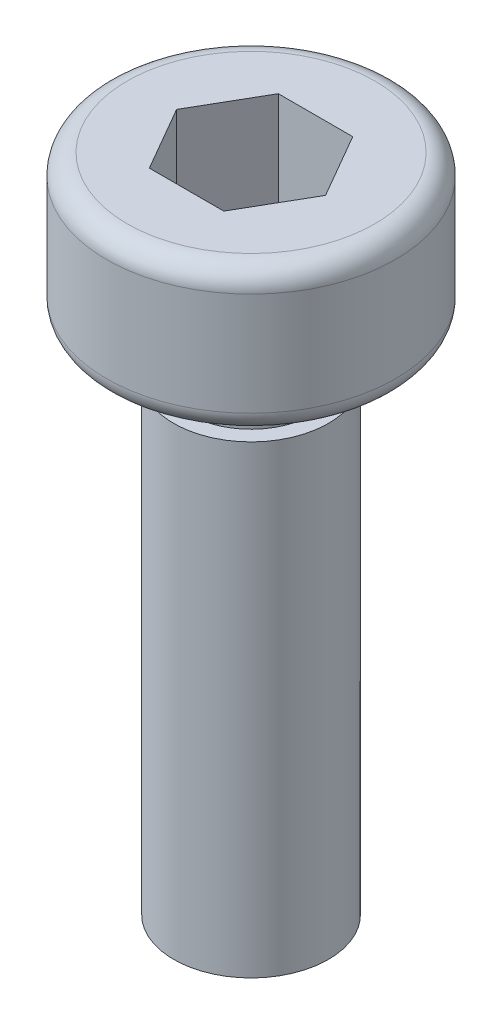
ISO-10303-21;
HEADER;
FILE_DESCRIPTION(('STEP AP214'),'2;1');
FILE_NAME('part.step','',(''),(''),'','','');
FILE_SCHEMA(('AUTOMOTIVE_DESIGN { 1 0 10303 214 1 1 1 1 }'));
ENDSEC;
DATA;
#1=APPLICATION_CONTEXT('core data for automotive mechanical design processes');
#2=APPLICATION_PROTOCOL_DEFINITION('international standard','automotive_design',2000,#1);
#3=PRODUCT_CONTEXT('',#1,'mechanical');
#4=PRODUCT('Part','Part','',(#3));
#5=PRODUCT_RELATED_PRODUCT_CATEGORY('part','',(#4));
#6=PRODUCT_DEFINITION_FORMATION('','',#4);
#7=PRODUCT_DEFINITION_CONTEXT('part definition',#1,'design');
#8=PRODUCT_DEFINITION('design','',#6,#7);
#9=PRODUCT_DEFINITION_SHAPE('','',#8);
#10=(LENGTH_UNIT() NAMED_UNIT(*) SI_UNIT(.MILLI.,.METRE.));
#11=(NAMED_UNIT(*) PLANE_ANGLE_UNIT() SI_UNIT($,.RADIAN.));
#12=(NAMED_UNIT(*) SI_UNIT($,.STERADIAN.) SOLID_ANGLE_UNIT());
#13=UNCERTAINTY_MEASURE_WITH_UNIT(LENGTH_MEASURE(1.E-05),#10,'distance_accuracy_value','');
#14=(GEOMETRIC_REPRESENTATION_CONTEXT(3) GLOBAL_UNCERTAINTY_ASSIGNED_CONTEXT((#13)) GLOBAL_UNIT_ASSIGNED_CONTEXT((#10,
#11,#12)) REPRESENTATION_CONTEXT('',''));
#15=CARTESIAN_POINT('',(0.,0.,0.));
#16=DIRECTION('',(0.,0.,1.));
#17=DIRECTION('',(1.,0.,0.));
#18=AXIS2_PLACEMENT_3D('',#15,#16,#17);
#19=CARTESIAN_POINT('',(0.,12.8,0.));
#20=DIRECTION('',(0.,-1.,0.));
#21=DIRECTION('',(0.,0.,-1.));
#22=AXIS2_PLACEMENT_3D('',#19,#20,#21);
#23=PLANE('',#22);
#24=DIRECTION('',(-0.5,0.,0.866025403784439));
#25=VECTOR('',#24,1.);
#26=CARTESIAN_POINT('',(-0.721687836487032,12.8,-1.25));
#27=LINE('',#26,#25);
#28=CARTESIAN_POINT('',(-0.721687836487032,12.8,-1.25));
#29=VERTEX_POINT('',#28);
#30=CARTESIAN_POINT('',(-1.44337567297406,12.8,0.));
#31=VERTEX_POINT('',#30);
#32=EDGE_CURVE('E124',#29,#31,#27,.T.);
#33=ORIENTED_EDGE('',*,*,#32,.F.);
#34=DIRECTION('',(-1.,0.,0.));
#35=VECTOR('',#34,1.);
#36=CARTESIAN_POINT('',(0.721687836487033,12.8,-1.25));
#37=LINE('',#36,#35);
#38=CARTESIAN_POINT('',(0.721687836487033,12.8,-1.25));
#39=VERTEX_POINT('',#38);
#40=EDGE_CURVE('E50',#39,#29,#37,.T.);
#41=ORIENTED_EDGE('',*,*,#40,.F.);
#42=DIRECTION('',(-0.5,0.,-0.866025403784439));
#43=VECTOR('',#42,1.);
#44=CARTESIAN_POINT('',(1.44337567297406,12.8,0.));
#45=LINE('',#44,#43);
#46=CARTESIAN_POINT('',(1.44337567297406,12.8,0.));
#47=VERTEX_POINT('',#46);
#48=EDGE_CURVE('E133',#47,#39,#45,.T.);
#49=ORIENTED_EDGE('',*,*,#48,.F.);
#50=DIRECTION('',(0.5,0.,-0.866025403784439));
#51=VECTOR('',#50,1.);
#52=CARTESIAN_POINT('',(0.721687836487032,12.8,1.25));
#53=LINE('',#52,#51);
#54=CARTESIAN_POINT('',(0.721687836487032,12.8,1.25));
#55=VERTEX_POINT('',#54);
#56=EDGE_CURVE('E131',#55,#47,#53,.T.);
#57=ORIENTED_EDGE('',*,*,#56,.F.);
#58=DIRECTION('',(1.,0.,0.));
#59=VECTOR('',#58,1.);
#60=CARTESIAN_POINT('',(-0.721687836487033,12.8,1.25));
#61=LINE('',#60,#59);
#62=CARTESIAN_POINT('',(-0.721687836487033,12.8,1.25));
#63=VERTEX_POINT('',#62);
#64=EDGE_CURVE('E98',#63,#55,#61,.T.);
#65=ORIENTED_EDGE('',*,*,#64,.F.);
#66=DIRECTION('',(0.5,0.,0.866025403784439));
#67=VECTOR('',#66,1.);
#68=CARTESIAN_POINT('',(-1.44337567297406,12.8,0.));
#69=LINE('',#68,#67);
#70=EDGE_CURVE('E127',#31,#63,#69,.T.);
#71=ORIENTED_EDGE('',*,*,#70,.F.);
#72=EDGE_LOOP('',(#33,#41,#49,#57,#65,#71));
#73=FACE_BOUND('',#72,.T.);
#74=CARTESIAN_POINT('',(0.,12.8,0.));
#75=DIRECTION('',(0.,-1.,0.));
#76=DIRECTION('',(0.,0.,-1.));
#77=AXIS2_PLACEMENT_3D('',#74,#75,#76);
#78=CIRCLE('',#77,2.4);
#79=CARTESIAN_POINT('',(0.,12.8,-2.4));
#80=VERTEX_POINT('',#79);
#81=EDGE_CURVE('E11',#80,#80,#78,.T.);
#82=ORIENTED_EDGE('',*,*,#81,.F.);
#83=EDGE_LOOP('',(#82));
#84=FACE_BOUND('',#83,.T.);
#85=ADVANCED_FACE('F36',(#73,#84),#23,.F.);
#86=CARTESIAN_POINT('',(0.,12.4,0.));
#87=DIRECTION('',(0.,-1.,0.));
#88=DIRECTION('',(0.,0.,-1.));
#89=AXIS2_PLACEMENT_3D('',#86,#87,#88);
#90=TOROIDAL_SURFACE('',#89,2.4,0.400000000000001);
#91=CARTESIAN_POINT('',(0.,12.4,0.));
#92=DIRECTION('',(0.,-1.,0.));
#93=DIRECTION('',(0.,0.,-1.));
#94=AXIS2_PLACEMENT_3D('',#91,#92,#93);
#95=CIRCLE('',#94,2.8);
#96=CARTESIAN_POINT('',(0.,12.4,-2.8));
#97=VERTEX_POINT('',#96);
#98=EDGE_CURVE('E43',#97,#97,#95,.T.);
#99=ORIENTED_EDGE('',*,*,#98,.F.);
#100=EDGE_LOOP('',(#99));
#101=FACE_BOUND('',#100,.T.);
#102=ORIENTED_EDGE('',*,*,#81,.T.);
#103=EDGE_LOOP('',(#102));
#104=FACE_BOUND('',#103,.T.);
#105=ADVANCED_FACE('F164',(#101,#104),#90,.T.);
#106=CARTESIAN_POINT('',(0.,0.,0.));
#107=DIRECTION('',(0.,-1.,0.));
#108=DIRECTION('',(0.,0.,-1.));
#109=AXIS2_PLACEMENT_3D('',#106,#107,#108);
#110=CYLINDRICAL_SURFACE('',#109,2.8);
#111=CARTESIAN_POINT('',(0.,10.4,0.));
#112=DIRECTION('',(0.,-1.,0.));
#113=DIRECTION('',(0.,0.,-1.));
#114=AXIS2_PLACEMENT_3D('',#111,#112,#113);
#115=CIRCLE('',#114,2.8);
#116=CARTESIAN_POINT('',(0.,10.4,-2.8));
#117=VERTEX_POINT('',#116);
#118=EDGE_CURVE('E157',#117,#117,#115,.T.);
#119=ORIENTED_EDGE('',*,*,#118,.F.);
#120=EDGE_LOOP('',(#119));
#121=FACE_BOUND('',#120,.T.);
#122=ORIENTED_EDGE('',*,*,#98,.T.);
#123=EDGE_LOOP('',(#122));
#124=FACE_BOUND('',#123,.T.);
#125=ADVANCED_FACE('F162',(#121,#124),#110,.T.);
#126=CARTESIAN_POINT('',(0.,10.4,0.));
#127=DIRECTION('',(0.,-1.,0.));
#128=DIRECTION('',(0.,0.,-1.));
#129=AXIS2_PLACEMENT_3D('',#126,#127,#128);
#130=TOROIDAL_SURFACE('',#129,2.4,0.4);
#131=CARTESIAN_POINT('',(0.,10.,0.));
#132=DIRECTION('',(0.,-1.,0.));
#133=DIRECTION('',(0.,0.,-1.));
#134=AXIS2_PLACEMENT_3D('',#131,#132,#133);
#135=CIRCLE('',#134,2.4);
#136=CARTESIAN_POINT('',(0.,10.,-2.4));
#137=VERTEX_POINT('',#136);
#138=EDGE_CURVE('E154',#137,#137,#135,.T.);
#139=ORIENTED_EDGE('',*,*,#138,.F.);
#140=EDGE_LOOP('',(#139));
#141=FACE_BOUND('',#140,.T.);
#142=ORIENTED_EDGE('',*,*,#118,.T.);
#143=EDGE_LOOP('',(#142));
#144=FACE_BOUND('',#143,.T.);
#145=ADVANCED_FACE('F209',(#141,#144),#130,.T.);
#146=CARTESIAN_POINT('',(-2.4,10.,0.));
#147=DIRECTION('',(0.,1.,0.));
#148=DIRECTION('',(0.,0.,1.));
#149=AXIS2_PLACEMENT_3D('',#146,#147,#148);
#150=PLANE('',#149);
#151=CARTESIAN_POINT('',(0.,10.,0.));
#152=DIRECTION('',(0.,-1.,0.));
#153=DIRECTION('',(0.,0.,-1.));
#154=AXIS2_PLACEMENT_3D('',#151,#152,#153);
#155=CIRCLE('',#154,1.2);
#156=CARTESIAN_POINT('',(0.,10.,-1.2));
#157=VERTEX_POINT('',#156);
#158=EDGE_CURVE('E151',#157,#157,#155,.T.);
#159=ORIENTED_EDGE('',*,*,#158,.F.);
#160=EDGE_LOOP('',(#159));
#161=FACE_BOUND('',#160,.T.);
#162=ORIENTED_EDGE('',*,*,#138,.T.);
#163=EDGE_LOOP('',(#162));
#164=FACE_BOUND('',#163,.T.);
#165=ADVANCED_FACE('F205',(#161,#164),#150,.F.);
#166=CARTESIAN_POINT('',(0.,0.,0.));
#167=DIRECTION('',(0.,-1.,0.));
#168=DIRECTION('',(0.,0.,-1.));
#169=AXIS2_PLACEMENT_3D('',#166,#167,#168);
#170=CYLINDRICAL_SURFACE('',#169,1.2);
#171=CARTESIAN_POINT('',(0.,9.,0.));
#172=DIRECTION('',(0.,-1.,0.));
#173=DIRECTION('',(0.,0.,-1.));
#174=AXIS2_PLACEMENT_3D('',#171,#172,#173);
#175=CIRCLE('',#174,1.2);
#176=CARTESIAN_POINT('',(0.,9.,-1.2));
#177=VERTEX_POINT('',#176);
#178=EDGE_CURVE('E148',#177,#177,#175,.T.);
#179=ORIENTED_EDGE('',*,*,#178,.F.);
#180=EDGE_LOOP('',(#179));
#181=FACE_BOUND('',#180,.T.);
#182=ORIENTED_EDGE('',*,*,#158,.T.);
#183=EDGE_LOOP('',(#182));
#184=FACE_BOUND('',#183,.T.);
#185=ADVANCED_FACE('F201',(#181,#184),#170,.T.);
#186=CARTESIAN_POINT('',(-1.2,9.,0.));
#187=DIRECTION('',(0.,-1.,0.));
#188=DIRECTION('',(0.,0.,-1.));
#189=AXIS2_PLACEMENT_3D('',#186,#187,#188);
#190=PLANE('',#189);
#191=CARTESIAN_POINT('',(0.,9.,0.));
#192=DIRECTION('',(0.,-1.,0.));
#193=DIRECTION('',(0.,0.,-1.));
#194=AXIS2_PLACEMENT_3D('',#191,#192,#193);
#195=CIRCLE('',#194,1.5);
#196=CARTESIAN_POINT('',(0.,9.,-1.5));
#197=VERTEX_POINT('',#196);
#198=EDGE_CURVE('E145',#197,#197,#195,.T.);
#199=ORIENTED_EDGE('',*,*,#198,.F.);
#200=EDGE_LOOP('',(#199));
#201=FACE_BOUND('',#200,.T.);
#202=ORIENTED_EDGE('',*,*,#178,.T.);
#203=EDGE_LOOP('',(#202));
#204=FACE_BOUND('',#203,.T.);
#205=ADVANCED_FACE('F197',(#201,#204),#190,.F.);
#206=CARTESIAN_POINT('',(0.,0.,0.));
#207=DIRECTION('',(0.,-1.,0.));
#208=DIRECTION('',(0.,0.,-1.));
#209=AXIS2_PLACEMENT_3D('',#206,#207,#208);
#210=CYLINDRICAL_SURFACE('',#209,1.5);
#211=CARTESIAN_POINT('',(0.,0.,0.));
#212=DIRECTION('',(0.,-1.,0.));
#213=DIRECTION('',(0.,0.,-1.));
#214=AXIS2_PLACEMENT_3D('',#211,#212,#213);
#215=CIRCLE('',#214,1.5);
#216=CARTESIAN_POINT('',(0.,0.,-1.5));
#217=VERTEX_POINT('',#216);
#218=EDGE_CURVE('E137',#217,#217,#215,.T.);
#219=ORIENTED_EDGE('',*,*,#218,.F.);
#220=EDGE_LOOP('',(#219));
#221=FACE_BOUND('',#220,.T.);
#222=ORIENTED_EDGE('',*,*,#198,.T.);
#223=EDGE_LOOP('',(#222));
#224=FACE_BOUND('',#223,.T.);
#225=ADVANCED_FACE('F189',(#221,#224),#210,.T.);
#226=CARTESIAN_POINT('',(-1.5,0.,0.));
#227=DIRECTION('',(0.,1.,0.));
#228=DIRECTION('',(0.,0.,1.));
#229=AXIS2_PLACEMENT_3D('',#226,#227,#228);
#230=PLANE('',#229);
#231=ORIENTED_EDGE('',*,*,#218,.T.);
#232=EDGE_LOOP('',(#231));
#233=FACE_BOUND('',#232,.T.);
#234=ADVANCED_FACE('F182',(#233),#230,.F.);
#235=CARTESIAN_POINT('',(0.721687836487033,10.8,-1.25));
#236=DIRECTION('',(0.,0.,-1.));
#237=DIRECTION('',(-1.,0.,0.));
#238=AXIS2_PLACEMENT_3D('',#235,#236,#237);
#239=PLANE('',#238);
#240=ORIENTED_EDGE('',*,*,#40,.T.);
#241=DIRECTION('',(0.,1.,0.));
#242=VECTOR('',#241,1.);
#243=CARTESIAN_POINT('',(-0.721687836487032,10.8,-1.25));
#244=LINE('',#243,#242);
#245=CARTESIAN_POINT('',(-0.721687836487032,10.8,-1.25));
#246=VERTEX_POINT('',#245);
#247=EDGE_CURVE('E80',#246,#29,#244,.T.);
#248=ORIENTED_EDGE('',*,*,#247,.F.);
#249=DIRECTION('',(-1.,0.,0.));
#250=VECTOR('',#249,1.);
#251=CARTESIAN_POINT('',(0.721687836487033,10.8,-1.25));
#252=LINE('',#251,#250);
#253=CARTESIAN_POINT('',(0.721687836487033,10.8,-1.25));
#254=VERTEX_POINT('',#253);
#255=EDGE_CURVE('E135',#254,#246,#252,.T.);
#256=ORIENTED_EDGE('',*,*,#255,.F.);
#257=DIRECTION('',(0.,1.,0.));
#258=VECTOR('',#257,1.);
#259=CARTESIAN_POINT('',(0.721687836487033,10.8,-1.25));
#260=LINE('',#259,#258);
#261=EDGE_CURVE('E58',#254,#39,#260,.T.);
#262=ORIENTED_EDGE('',*,*,#261,.T.);
#263=EDGE_LOOP('',(#240,#248,#256,#262));
#264=FACE_BOUND('',#263,.T.);
#265=ADVANCED_FACE('F179',(#264),#239,.F.);
#266=CARTESIAN_POINT('',(1.44337567297406,10.8,0.));
#267=DIRECTION('',(0.866025403784439,0.,-0.5));
#268=DIRECTION('',(-0.5,0.,-0.866025403784439));
#269=AXIS2_PLACEMENT_3D('',#266,#267,#268);
#270=PLANE('',#269);
#271=ORIENTED_EDGE('',*,*,#48,.T.);
#272=ORIENTED_EDGE('',*,*,#261,.F.);
#273=DIRECTION('',(-0.5,0.,-0.866025403784439));
#274=VECTOR('',#273,1.);
#275=CARTESIAN_POINT('',(1.44337567297406,10.8,0.));
#276=LINE('',#275,#274);
#277=CARTESIAN_POINT('',(1.44337567297406,10.8,0.));
#278=VERTEX_POINT('',#277);
#279=EDGE_CURVE('E110',#278,#254,#276,.T.);
#280=ORIENTED_EDGE('',*,*,#279,.F.);
#281=DIRECTION('',(0.,1.,0.));
#282=VECTOR('',#281,1.);
#283=CARTESIAN_POINT('',(1.44337567297406,10.8,0.));
#284=LINE('',#283,#282);
#285=EDGE_CURVE('E102',#278,#47,#284,.T.);
#286=ORIENTED_EDGE('',*,*,#285,.T.);
#287=EDGE_LOOP('',(#271,#272,#280,#286));
#288=FACE_BOUND('',#287,.T.);
#289=ADVANCED_FACE('F181',(#288),#270,.F.);
#290=CARTESIAN_POINT('',(0.721687836487032,10.8,1.25));
#291=DIRECTION('',(0.866025403784439,0.,0.5));
#292=DIRECTION('',(0.5,0.,-0.866025403784439));
#293=AXIS2_PLACEMENT_3D('',#290,#291,#292);
#294=PLANE('',#293);
#295=ORIENTED_EDGE('',*,*,#56,.T.);
#296=ORIENTED_EDGE('',*,*,#285,.F.);
#297=DIRECTION('',(0.5,0.,-0.866025403784439));
#298=VECTOR('',#297,1.);
#299=CARTESIAN_POINT('',(0.721687836487032,10.8,1.25));
#300=LINE('',#299,#298);
#301=CARTESIAN_POINT('',(0.721687836487032,10.8,1.25));
#302=VERTEX_POINT('',#301);
#303=EDGE_CURVE('E106',#302,#278,#300,.T.);
#304=ORIENTED_EDGE('',*,*,#303,.F.);
#305=DIRECTION('',(0.,1.,0.));
#306=VECTOR('',#305,1.);
#307=CARTESIAN_POINT('',(0.721687836487032,10.8,1.25));
#308=LINE('',#307,#306);
#309=EDGE_CURVE('E91',#302,#55,#308,.T.);
#310=ORIENTED_EDGE('',*,*,#309,.T.);
#311=EDGE_LOOP('',(#295,#296,#304,#310));
#312=FACE_BOUND('',#311,.T.);
#313=ADVANCED_FACE('F107',(#312),#294,.F.);
#314=CARTESIAN_POINT('',(-0.721687836487033,10.8,1.25));
#315=DIRECTION('',(0.,0.,1.));
#316=DIRECTION('',(1.,0.,0.));
#317=AXIS2_PLACEMENT_3D('',#314,#315,#316);
#318=PLANE('',#317);
#319=ORIENTED_EDGE('',*,*,#64,.T.);
#320=ORIENTED_EDGE('',*,*,#309,.F.);
#321=DIRECTION('',(1.,0.,0.));
#322=VECTOR('',#321,1.);
#323=CARTESIAN_POINT('',(-0.721687836487033,10.8,1.25));
#324=LINE('',#323,#322);
#325=CARTESIAN_POINT('',(-0.721687836487033,10.8,1.25));
#326=VERTEX_POINT('',#325);
#327=EDGE_CURVE('E95',#326,#302,#324,.T.);
#328=ORIENTED_EDGE('',*,*,#327,.F.);
#329=DIRECTION('',(0.,1.,0.));
#330=VECTOR('',#329,1.);
#331=CARTESIAN_POINT('',(-0.721687836487033,10.8,1.25));
#332=LINE('',#331,#330);
#333=EDGE_CURVE('E103',#326,#63,#332,.T.);
#334=ORIENTED_EDGE('',*,*,#333,.T.);
#335=EDGE_LOOP('',(#319,#320,#328,#334));
#336=FACE_BOUND('',#335,.T.);
#337=ADVANCED_FACE('F93',(#336),#318,.F.);
#338=CARTESIAN_POINT('',(-1.44337567297406,10.8,0.));
#339=DIRECTION('',(-0.866025403784439,0.,0.5));
#340=DIRECTION('',(0.5,0.,0.866025403784439));
#341=AXIS2_PLACEMENT_3D('',#338,#339,#340);
#342=PLANE('',#341);
#343=ORIENTED_EDGE('',*,*,#70,.T.);
#344=ORIENTED_EDGE('',*,*,#333,.F.);
#345=DIRECTION('',(0.5,0.,0.866025403784439));
#346=VECTOR('',#345,1.);
#347=CARTESIAN_POINT('',(-1.44337567297406,10.8,0.));
#348=LINE('',#347,#346);
#349=CARTESIAN_POINT('',(-1.44337567297406,10.8,0.));
#350=VERTEX_POINT('',#349);
#351=EDGE_CURVE('E116',#350,#326,#348,.T.);
#352=ORIENTED_EDGE('',*,*,#351,.F.);
#353=DIRECTION('',(0.,1.,0.));
#354=VECTOR('',#353,1.);
#355=CARTESIAN_POINT('',(-1.44337567297406,10.8,0.));
#356=LINE('',#355,#354);
#357=EDGE_CURVE('E140',#350,#31,#356,.T.);
#358=ORIENTED_EDGE('',*,*,#357,.T.);
#359=EDGE_LOOP('',(#343,#344,#352,#358));
#360=FACE_BOUND('',#359,.T.);
#361=ADVANCED_FACE('F280',(#360),#342,.F.);
#362=CARTESIAN_POINT('',(-0.721687836487032,10.8,-1.25));
#363=DIRECTION('',(-0.866025403784439,0.,-0.5));
#364=DIRECTION('',(-0.5,0.,0.866025403784439));
#365=AXIS2_PLACEMENT_3D('',#362,#363,#364);
#366=PLANE('',#365);
#367=ORIENTED_EDGE('',*,*,#32,.T.);
#368=ORIENTED_EDGE('',*,*,#357,.F.);
#369=DIRECTION('',(-0.5,0.,0.866025403784439));
#370=VECTOR('',#369,1.);
#371=CARTESIAN_POINT('',(-0.721687836487032,10.8,-1.25));
#372=LINE('',#371,#370);
#373=EDGE_CURVE('E118',#246,#350,#372,.T.);
#374=ORIENTED_EDGE('',*,*,#373,.F.);
#375=ORIENTED_EDGE('',*,*,#247,.T.);
#376=EDGE_LOOP('',(#367,#368,#374,#375));
#377=FACE_BOUND('',#376,.T.);
#378=ADVANCED_FACE('F177',(#377),#366,.F.);
#379=CARTESIAN_POINT('',(0.,10.8,0.));
#380=DIRECTION('',(0.,1.,0.));
#381=DIRECTION('',(0.,0.,1.));
#382=AXIS2_PLACEMENT_3D('',#379,#380,#381);
#383=PLANE('',#382);
#384=ORIENTED_EDGE('',*,*,#255,.T.);
#385=ORIENTED_EDGE('',*,*,#373,.T.);
#386=ORIENTED_EDGE('',*,*,#351,.T.);
#387=ORIENTED_EDGE('',*,*,#327,.T.);
#388=ORIENTED_EDGE('',*,*,#303,.T.);
#389=ORIENTED_EDGE('',*,*,#279,.T.);
#390=EDGE_LOOP('',(#384,#385,#386,#387,#388,#389));
#391=FACE_BOUND('',#390,.T.);
#392=ADVANCED_FACE('F113',(#391),#383,.T.);
#393=CLOSED_SHELL('',(#85,#105,#125,#145,#165,#185,#205,#225,#234,#265,#289,#313,#337,#361,#378,#392));
#394=MANIFOLD_SOLID_BREP('B2',#393);
#395=ADVANCED_BREP_SHAPE_REPRESENTATION('',(#18,#394),#14);
#396=SHAPE_DEFINITION_REPRESENTATION(#9,#395);
ENDSEC;
END-ISO-10303-21;
